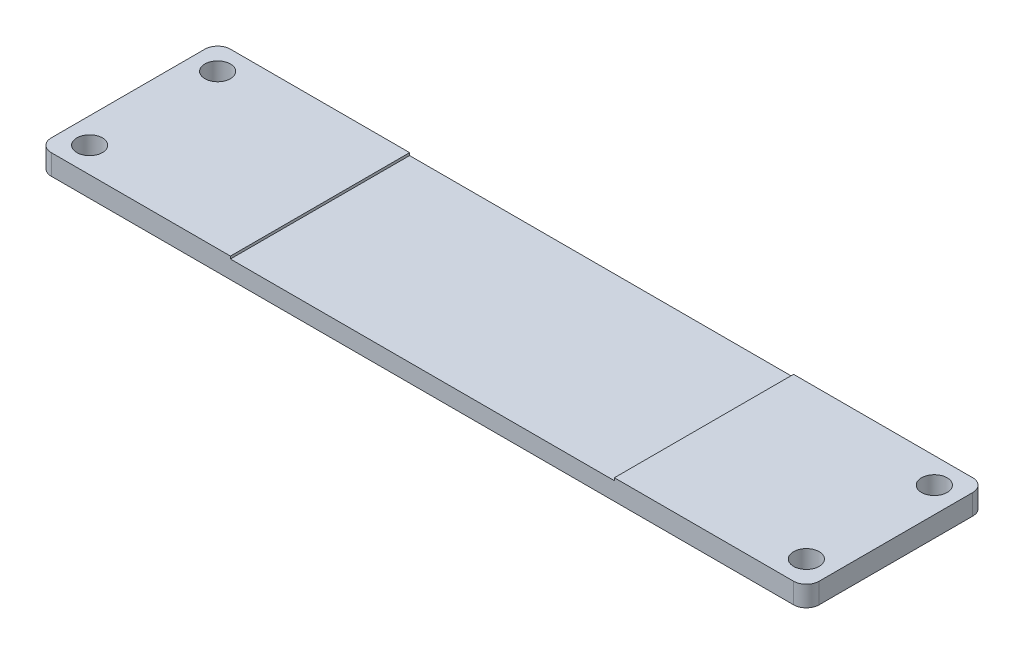
ISO-10303-21;
HEADER;
FILE_DESCRIPTION(('STEP AP214'),'2;1');
FILE_NAME('part.step','',(''),(''),'','','');
FILE_SCHEMA(('AUTOMOTIVE_DESIGN { 1 0 10303 214 1 1 1 1 }'));
ENDSEC;
DATA;
#1=APPLICATION_CONTEXT('core data for automotive mechanical design processes');
#2=APPLICATION_PROTOCOL_DEFINITION('international standard','automotive_design',2000,#1);
#3=PRODUCT_CONTEXT('',#1,'mechanical');
#4=PRODUCT('Part','Part','',(#3));
#5=PRODUCT_RELATED_PRODUCT_CATEGORY('part','',(#4));
#6=PRODUCT_DEFINITION_FORMATION('','',#4);
#7=PRODUCT_DEFINITION_CONTEXT('part definition',#1,'design');
#8=PRODUCT_DEFINITION('design','',#6,#7);
#9=PRODUCT_DEFINITION_SHAPE('','',#8);
#10=(LENGTH_UNIT() NAMED_UNIT(*) SI_UNIT(.MILLI.,.METRE.));
#11=(NAMED_UNIT(*) PLANE_ANGLE_UNIT() SI_UNIT($,.RADIAN.));
#12=(NAMED_UNIT(*) SI_UNIT($,.STERADIAN.) SOLID_ANGLE_UNIT());
#13=UNCERTAINTY_MEASURE_WITH_UNIT(LENGTH_MEASURE(1.E-05),#10,'distance_accuracy_value','');
#14=(GEOMETRIC_REPRESENTATION_CONTEXT(3) GLOBAL_UNCERTAINTY_ASSIGNED_CONTEXT((#13)) GLOBAL_UNIT_ASSIGNED_CONTEXT((#10,
#11,#12)) REPRESENTATION_CONTEXT('',''));
#15=CARTESIAN_POINT('',(0.,0.,0.));
#16=DIRECTION('',(0.,0.,1.));
#17=DIRECTION('',(1.,0.,0.));
#18=AXIS2_PLACEMENT_3D('',#15,#16,#17);
#19=CARTESIAN_POINT('',(0.,0.8,0.));
#20=DIRECTION('',(0.,1.,0.));
#21=DIRECTION('',(0.,0.,1.));
#22=AXIS2_PLACEMENT_3D('',#19,#20,#21);
#23=PLANE('',#22);
#24=DIRECTION('',(0.,0.,1.));
#25=VECTOR('',#24,1.);
#26=CARTESIAN_POINT('',(-7.5,0.8,3.5));
#27=LINE('',#26,#25);
#28=CARTESIAN_POINT('',(-7.5,0.8,-3.5));
#29=VERTEX_POINT('',#28);
#30=CARTESIAN_POINT('',(-7.5,0.8,3.5));
#31=VERTEX_POINT('',#30);
#32=EDGE_CURVE('E131',#29,#31,#27,.T.);
#33=ORIENTED_EDGE('',*,*,#32,.F.);
#34=DIRECTION('',(-1.,0.,0.));
#35=VECTOR('',#34,1.);
#36=CARTESIAN_POINT('',(15.,0.8,-3.5));
#37=LINE('',#36,#35);
#38=CARTESIAN_POINT('',(-14.5,0.8,-3.5));
#39=VERTEX_POINT('',#38);
#40=EDGE_CURVE('E60',#29,#39,#37,.T.);
#41=ORIENTED_EDGE('',*,*,#40,.T.);
#42=CARTESIAN_POINT('',(-14.5,0.8,-3.));
#43=DIRECTION('',(0.,1.,0.));
#44=DIRECTION('',(0.,0.,1.));
#45=AXIS2_PLACEMENT_3D('',#42,#43,#44);
#46=CIRCLE('',#45,0.5);
#47=CARTESIAN_POINT('',(-15.,0.8,-3.));
#48=VERTEX_POINT('',#47);
#49=EDGE_CURVE('E229',#39,#48,#46,.T.);
#50=ORIENTED_EDGE('',*,*,#49,.T.);
#51=DIRECTION('',(0.,0.,1.));
#52=VECTOR('',#51,1.);
#53=CARTESIAN_POINT('',(-15.,0.8,3.5));
#54=LINE('',#53,#52);
#55=CARTESIAN_POINT('',(-15.,0.8,3.));
#56=VERTEX_POINT('',#55);
#57=EDGE_CURVE('E187',#48,#56,#54,.T.);
#58=ORIENTED_EDGE('',*,*,#57,.T.);
#59=CARTESIAN_POINT('',(-14.5,0.8,3.));
#60=DIRECTION('',(0.,1.,0.));
#61=DIRECTION('',(0.,0.,1.));
#62=AXIS2_PLACEMENT_3D('',#59,#60,#61);
#63=CIRCLE('',#62,0.5);
#64=CARTESIAN_POINT('',(-14.5,0.8,3.5));
#65=VERTEX_POINT('',#64);
#66=EDGE_CURVE('E235',#56,#65,#63,.T.);
#67=ORIENTED_EDGE('',*,*,#66,.T.);
#68=DIRECTION('',(1.,0.,0.));
#69=VECTOR('',#68,1.);
#70=CARTESIAN_POINT('',(15.,0.8,3.5));
#71=LINE('',#70,#69);
#72=EDGE_CURVE('E192',#65,#31,#71,.T.);
#73=ORIENTED_EDGE('',*,*,#72,.T.);
#74=EDGE_LOOP('',(#33,#41,#50,#58,#67,#73));
#75=FACE_BOUND('',#74,.T.);
#76=CARTESIAN_POINT('',(-14.,0.8,-2.5));
#77=DIRECTION('',(0.,1.,0.));
#78=DIRECTION('',(0.,0.,1.));
#79=AXIS2_PLACEMENT_3D('',#76,#77,#78);
#80=CIRCLE('',#79,0.500000000000001);
#81=CARTESIAN_POINT('',(-14.,0.8,-2.));
#82=VERTEX_POINT('',#81);
#83=EDGE_CURVE('E166',#82,#82,#80,.T.);
#84=ORIENTED_EDGE('',*,*,#83,.F.);
#85=EDGE_LOOP('',(#84));
#86=FACE_BOUND('',#85,.T.);
#87=CARTESIAN_POINT('',(-14.,0.8,2.5));
#88=DIRECTION('',(0.,1.,0.));
#89=DIRECTION('',(0.,0.,-1.));
#90=AXIS2_PLACEMENT_3D('',#87,#88,#89);
#91=CIRCLE('',#90,0.500000000000001);
#92=CARTESIAN_POINT('',(-14.,0.8,2.));
#93=VERTEX_POINT('',#92);
#94=EDGE_CURVE('E158',#93,#93,#91,.T.);
#95=ORIENTED_EDGE('',*,*,#94,.F.);
#96=EDGE_LOOP('',(#95));
#97=FACE_BOUND('',#96,.T.);
#98=ADVANCED_FACE('F37',(#75,#86,#97),#23,.T.);
#99=CARTESIAN_POINT('',(-15.,0.8,3.5));
#100=DIRECTION('',(1.,0.,0.));
#101=DIRECTION('',(0.,0.,-1.));
#102=AXIS2_PLACEMENT_3D('',#99,#100,#101);
#103=PLANE('',#102);
#104=DIRECTION('',(0.,0.,1.));
#105=VECTOR('',#104,1.);
#106=CARTESIAN_POINT('',(-15.,0.,3.5));
#107=LINE('',#106,#105);
#108=CARTESIAN_POINT('',(-15.,0.,-3.));
#109=VERTEX_POINT('',#108);
#110=CARTESIAN_POINT('',(-15.,0.,3.));
#111=VERTEX_POINT('',#110);
#112=EDGE_CURVE('E184',#109,#111,#107,.T.);
#113=ORIENTED_EDGE('',*,*,#112,.T.);
#114=DIRECTION('',(0.,-1.,0.));
#115=VECTOR('',#114,1.);
#116=CARTESIAN_POINT('',(-15.,0.8,3.));
#117=LINE('',#116,#115);
#118=EDGE_CURVE('E227',#111,#56,#117,.F.);
#119=ORIENTED_EDGE('',*,*,#118,.T.);
#120=ORIENTED_EDGE('',*,*,#57,.F.);
#121=DIRECTION('',(0.,-1.,0.));
#122=VECTOR('',#121,1.);
#123=CARTESIAN_POINT('',(-15.,0.8,-3.));
#124=LINE('',#123,#122);
#125=EDGE_CURVE('E224',#48,#109,#124,.T.);
#126=ORIENTED_EDGE('',*,*,#125,.T.);
#127=EDGE_LOOP('',(#113,#119,#120,#126));
#128=FACE_BOUND('',#127,.T.);
#129=ADVANCED_FACE('F252',(#128),#103,.F.);
#130=CARTESIAN_POINT('',(15.,0.8,3.5));
#131=DIRECTION('',(0.,0.,-1.));
#132=DIRECTION('',(-1.,0.,0.));
#133=AXIS2_PLACEMENT_3D('',#130,#131,#132);
#134=PLANE('',#133);
#135=DIRECTION('',(1.,0.,0.));
#136=VECTOR('',#135,1.);
#137=CARTESIAN_POINT('',(7.5,0.7,3.5));
#138=LINE('',#137,#136);
#139=CARTESIAN_POINT('',(-7.5,0.7,3.5));
#140=VERTEX_POINT('',#139);
#141=CARTESIAN_POINT('',(7.5,0.7,3.5));
#142=VERTEX_POINT('',#141);
#143=EDGE_CURVE('E142',#140,#142,#138,.T.);
#144=ORIENTED_EDGE('',*,*,#143,.F.);
#145=DIRECTION('',(0.,1.,0.));
#146=VECTOR('',#145,1.);
#147=CARTESIAN_POINT('',(-7.5,0.7,3.5));
#148=LINE('',#147,#146);
#149=EDGE_CURVE('E126',#140,#31,#148,.T.);
#150=ORIENTED_EDGE('',*,*,#149,.T.);
#151=ORIENTED_EDGE('',*,*,#72,.F.);
#152=DIRECTION('',(0.,-1.,0.));
#153=VECTOR('',#152,1.);
#154=CARTESIAN_POINT('',(-14.5,0.8,3.5));
#155=LINE('',#154,#153);
#156=CARTESIAN_POINT('',(-14.5,0.,3.5));
#157=VERTEX_POINT('',#156);
#158=EDGE_CURVE('E213',#65,#157,#155,.T.);
#159=ORIENTED_EDGE('',*,*,#158,.T.);
#160=DIRECTION('',(1.,0.,0.));
#161=VECTOR('',#160,1.);
#162=CARTESIAN_POINT('',(15.,0.,3.5));
#163=LINE('',#162,#161);
#164=CARTESIAN_POINT('',(14.5,0.,3.5));
#165=VERTEX_POINT('',#164);
#166=EDGE_CURVE('E203',#157,#165,#163,.T.);
#167=ORIENTED_EDGE('',*,*,#166,.T.);
#168=DIRECTION('',(0.,-1.,0.));
#169=VECTOR('',#168,1.);
#170=CARTESIAN_POINT('',(14.5,0.8,3.5));
#171=LINE('',#170,#169);
#172=CARTESIAN_POINT('',(14.5,0.8,3.5));
#173=VERTEX_POINT('',#172);
#174=EDGE_CURVE('E200',#165,#173,#171,.F.);
#175=ORIENTED_EDGE('',*,*,#174,.T.);
#176=CARTESIAN_POINT('',(7.5,0.8,3.5));
#177=VERTEX_POINT('',#176);
#178=EDGE_CURVE('E190',#177,#173,#71,.T.);
#179=ORIENTED_EDGE('',*,*,#178,.F.);
#180=DIRECTION('',(0.,1.,0.));
#181=VECTOR('',#180,1.);
#182=CARTESIAN_POINT('',(7.5,0.7,3.5));
#183=LINE('',#182,#181);
#184=EDGE_CURVE('E52',#142,#177,#183,.T.);
#185=ORIENTED_EDGE('',*,*,#184,.F.);
#186=EDGE_LOOP('',(#144,#150,#151,#159,#167,#175,#179,#185));
#187=FACE_BOUND('',#186,.T.);
#188=ADVANCED_FACE('F147',(#187),#134,.F.);
#189=CARTESIAN_POINT('',(15.,0.8,3.5));
#190=DIRECTION('',(-1.,0.,0.));
#191=DIRECTION('',(0.,0.,1.));
#192=AXIS2_PLACEMENT_3D('',#189,#190,#191);
#193=PLANE('',#192);
#194=DIRECTION('',(0.,0.,-1.));
#195=VECTOR('',#194,1.);
#196=CARTESIAN_POINT('',(15.,0.8,3.5));
#197=LINE('',#196,#195);
#198=CARTESIAN_POINT('',(15.,0.8,3.));
#199=VERTEX_POINT('',#198);
#200=CARTESIAN_POINT('',(15.,0.8,-3.));
#201=VERTEX_POINT('',#200);
#202=EDGE_CURVE('E194',#199,#201,#197,.T.);
#203=ORIENTED_EDGE('',*,*,#202,.F.);
#204=DIRECTION('',(0.,-1.,0.));
#205=VECTOR('',#204,1.);
#206=CARTESIAN_POINT('',(15.,0.8,3.));
#207=LINE('',#206,#205);
#208=CARTESIAN_POINT('',(15.,0.,3.));
#209=VERTEX_POINT('',#208);
#210=EDGE_CURVE('E239',#199,#209,#207,.T.);
#211=ORIENTED_EDGE('',*,*,#210,.T.);
#212=DIRECTION('',(0.,0.,-1.));
#213=VECTOR('',#212,1.);
#214=CARTESIAN_POINT('',(15.,0.,3.5));
#215=LINE('',#214,#213);
#216=CARTESIAN_POINT('',(15.,0.,-3.));
#217=VERTEX_POINT('',#216);
#218=EDGE_CURVE('E206',#209,#217,#215,.T.);
#219=ORIENTED_EDGE('',*,*,#218,.T.);
#220=DIRECTION('',(0.,-1.,0.));
#221=VECTOR('',#220,1.);
#222=CARTESIAN_POINT('',(15.,0.8,-3.));
#223=LINE('',#222,#221);
#224=EDGE_CURVE('E237',#217,#201,#223,.F.);
#225=ORIENTED_EDGE('',*,*,#224,.T.);
#226=EDGE_LOOP('',(#203,#211,#219,#225));
#227=FACE_BOUND('',#226,.T.);
#228=ADVANCED_FACE('F269',(#227),#193,.F.);
#229=CARTESIAN_POINT('',(15.,0.8,-3.5));
#230=DIRECTION('',(0.,0.,1.));
#231=DIRECTION('',(1.,0.,0.));
#232=AXIS2_PLACEMENT_3D('',#229,#230,#231);
#233=PLANE('',#232);
#234=ORIENTED_EDGE('',*,*,#40,.F.);
#235=DIRECTION('',(0.,1.,0.));
#236=VECTOR('',#235,1.);
#237=CARTESIAN_POINT('',(-7.5,0.7,-3.5));
#238=LINE('',#237,#236);
#239=CARTESIAN_POINT('',(-7.5,0.7,-3.5));
#240=VERTEX_POINT('',#239);
#241=EDGE_CURVE('E156',#240,#29,#238,.T.);
#242=ORIENTED_EDGE('',*,*,#241,.F.);
#243=DIRECTION('',(-1.,0.,0.));
#244=VECTOR('',#243,1.);
#245=CARTESIAN_POINT('',(7.5,0.7,-3.5));
#246=LINE('',#245,#244);
#247=CARTESIAN_POINT('',(7.5,0.7,-3.5));
#248=VERTEX_POINT('',#247);
#249=EDGE_CURVE('E136',#248,#240,#246,.T.);
#250=ORIENTED_EDGE('',*,*,#249,.F.);
#251=DIRECTION('',(0.,1.,0.));
#252=VECTOR('',#251,1.);
#253=CARTESIAN_POINT('',(7.5,0.7,-3.5));
#254=LINE('',#253,#252);
#255=CARTESIAN_POINT('',(7.5,0.8,-3.5));
#256=VERTEX_POINT('',#255);
#257=EDGE_CURVE('E159',#248,#256,#254,.T.);
#258=ORIENTED_EDGE('',*,*,#257,.T.);
#259=CARTESIAN_POINT('',(14.5,0.8,-3.5));
#260=VERTEX_POINT('',#259);
#261=EDGE_CURVE('E197',#260,#256,#37,.T.);
#262=ORIENTED_EDGE('',*,*,#261,.F.);
#263=DIRECTION('',(0.,-1.,0.));
#264=VECTOR('',#263,1.);
#265=CARTESIAN_POINT('',(14.5,0.8,-3.5));
#266=LINE('',#265,#264);
#267=CARTESIAN_POINT('',(14.5,0.,-3.5));
#268=VERTEX_POINT('',#267);
#269=EDGE_CURVE('E11',#260,#268,#266,.T.);
#270=ORIENTED_EDGE('',*,*,#269,.T.);
#271=DIRECTION('',(-1.,0.,0.));
#272=VECTOR('',#271,1.);
#273=CARTESIAN_POINT('',(15.,0.,-3.5));
#274=LINE('',#273,#272);
#275=CARTESIAN_POINT('',(-14.5,0.,-3.5));
#276=VERTEX_POINT('',#275);
#277=EDGE_CURVE('E191',#268,#276,#274,.T.);
#278=ORIENTED_EDGE('',*,*,#277,.T.);
#279=DIRECTION('',(0.,-1.,0.));
#280=VECTOR('',#279,1.);
#281=CARTESIAN_POINT('',(-14.5,0.8,-3.5));
#282=LINE('',#281,#280);
#283=EDGE_CURVE('E45',#276,#39,#282,.F.);
#284=ORIENTED_EDGE('',*,*,#283,.T.);
#285=EDGE_LOOP('',(#234,#242,#250,#258,#262,#270,#278,#284));
#286=FACE_BOUND('',#285,.T.);
#287=ADVANCED_FACE('F244',(#286),#233,.F.);
#288=DIRECTION('',(0.,0.,-1.));
#289=VECTOR('',#288,1.);
#290=CARTESIAN_POINT('',(7.5,0.8,3.5));
#291=LINE('',#290,#289);
#292=EDGE_CURVE('E145',#177,#256,#291,.T.);
#293=ORIENTED_EDGE('',*,*,#292,.F.);
#294=ORIENTED_EDGE('',*,*,#178,.T.);
#295=CARTESIAN_POINT('',(14.5,0.8,3.));
#296=DIRECTION('',(0.,1.,0.));
#297=DIRECTION('',(0.,0.,1.));
#298=AXIS2_PLACEMENT_3D('',#295,#296,#297);
#299=CIRCLE('',#298,0.5);
#300=EDGE_CURVE('E233',#173,#199,#299,.T.);
#301=ORIENTED_EDGE('',*,*,#300,.T.);
#302=ORIENTED_EDGE('',*,*,#202,.T.);
#303=CARTESIAN_POINT('',(14.5,0.8,-3.));
#304=DIRECTION('',(0.,1.,0.));
#305=DIRECTION('',(0.,0.,1.));
#306=AXIS2_PLACEMENT_3D('',#303,#304,#305);
#307=CIRCLE('',#306,0.5);
#308=EDGE_CURVE('E231',#201,#260,#307,.T.);
#309=ORIENTED_EDGE('',*,*,#308,.T.);
#310=ORIENTED_EDGE('',*,*,#261,.T.);
#311=EDGE_LOOP('',(#293,#294,#301,#302,#309,#310));
#312=FACE_BOUND('',#311,.T.);
#313=CARTESIAN_POINT('',(14.,0.8,2.50000000000001));
#314=DIRECTION('',(0.,1.,0.));
#315=DIRECTION('',(0.,0.,1.));
#316=AXIS2_PLACEMENT_3D('',#313,#314,#315);
#317=CIRCLE('',#316,0.500000000000001);
#318=CARTESIAN_POINT('',(14.,0.8,3.00000000000001));
#319=VERTEX_POINT('',#318);
#320=EDGE_CURVE('E173',#319,#319,#317,.T.);
#321=ORIENTED_EDGE('',*,*,#320,.F.);
#322=EDGE_LOOP('',(#321));
#323=FACE_BOUND('',#322,.T.);
#324=CARTESIAN_POINT('',(14.,0.8,-2.50000000000001));
#325=DIRECTION('',(0.,1.,0.));
#326=DIRECTION('',(0.,0.,-1.));
#327=AXIS2_PLACEMENT_3D('',#324,#325,#326);
#328=CIRCLE('',#327,0.500000000000001);
#329=CARTESIAN_POINT('',(14.,0.8,-3.00000000000001));
#330=VERTEX_POINT('',#329);
#331=EDGE_CURVE('E167',#330,#330,#328,.T.);
#332=ORIENTED_EDGE('',*,*,#331,.F.);
#333=EDGE_LOOP('',(#332));
#334=FACE_BOUND('',#333,.T.);
#335=ADVANCED_FACE('F273',(#312,#323,#334),#23,.T.);
#336=CARTESIAN_POINT('',(0.,0.,0.));
#337=DIRECTION('',(0.,1.,0.));
#338=DIRECTION('',(0.,0.,1.));
#339=AXIS2_PLACEMENT_3D('',#336,#337,#338);
#340=PLANE('',#339);
#341=CARTESIAN_POINT('',(-14.,0.,2.5));
#342=DIRECTION('',(0.,1.,0.));
#343=DIRECTION('',(0.,0.,-1.));
#344=AXIS2_PLACEMENT_3D('',#341,#342,#343);
#345=CIRCLE('',#344,0.500000000000001);
#346=CARTESIAN_POINT('',(-14.,0.,2.));
#347=VERTEX_POINT('',#346);
#348=EDGE_CURVE('E176',#347,#347,#345,.T.);
#349=ORIENTED_EDGE('',*,*,#348,.T.);
#350=EDGE_LOOP('',(#349));
#351=FACE_BOUND('',#350,.T.);
#352=CARTESIAN_POINT('',(14.,0.,2.50000000000001));
#353=DIRECTION('',(0.,1.,0.));
#354=DIRECTION('',(0.,0.,1.));
#355=AXIS2_PLACEMENT_3D('',#352,#353,#354);
#356=CIRCLE('',#355,0.500000000000001);
#357=CARTESIAN_POINT('',(14.,0.,3.00000000000001));
#358=VERTEX_POINT('',#357);
#359=EDGE_CURVE('E170',#358,#358,#356,.T.);
#360=ORIENTED_EDGE('',*,*,#359,.T.);
#361=EDGE_LOOP('',(#360));
#362=FACE_BOUND('',#361,.T.);
#363=CARTESIAN_POINT('',(14.,0.,-2.50000000000001));
#364=DIRECTION('',(0.,1.,0.));
#365=DIRECTION('',(0.,0.,-1.));
#366=AXIS2_PLACEMENT_3D('',#363,#364,#365);
#367=CIRCLE('',#366,0.500000000000001);
#368=CARTESIAN_POINT('',(14.,0.,-3.00000000000001));
#369=VERTEX_POINT('',#368);
#370=EDGE_CURVE('E163',#369,#369,#367,.T.);
#371=ORIENTED_EDGE('',*,*,#370,.T.);
#372=EDGE_LOOP('',(#371));
#373=FACE_BOUND('',#372,.T.);
#374=CARTESIAN_POINT('',(-14.,0.,-2.5));
#375=DIRECTION('',(0.,1.,0.));
#376=DIRECTION('',(0.,0.,1.));
#377=AXIS2_PLACEMENT_3D('',#374,#375,#376);
#378=CIRCLE('',#377,0.500000000000001);
#379=CARTESIAN_POINT('',(-14.,0.,-2.));
#380=VERTEX_POINT('',#379);
#381=EDGE_CURVE('E181',#380,#380,#378,.T.);
#382=ORIENTED_EDGE('',*,*,#381,.T.);
#383=EDGE_LOOP('',(#382));
#384=FACE_BOUND('',#383,.T.);
#385=ORIENTED_EDGE('',*,*,#166,.F.);
#386=CARTESIAN_POINT('',(-14.5,0.,3.));
#387=DIRECTION('',(0.,1.,0.));
#388=DIRECTION('',(0.,0.,1.));
#389=AXIS2_PLACEMENT_3D('',#386,#387,#388);
#390=CIRCLE('',#389,0.5);
#391=EDGE_CURVE('E222',#157,#111,#390,.F.);
#392=ORIENTED_EDGE('',*,*,#391,.T.);
#393=ORIENTED_EDGE('',*,*,#112,.F.);
#394=CARTESIAN_POINT('',(-14.5,0.,-3.));
#395=DIRECTION('',(0.,1.,0.));
#396=DIRECTION('',(0.,0.,1.));
#397=AXIS2_PLACEMENT_3D('',#394,#395,#396);
#398=CIRCLE('',#397,0.5);
#399=EDGE_CURVE('E216',#109,#276,#398,.F.);
#400=ORIENTED_EDGE('',*,*,#399,.T.);
#401=ORIENTED_EDGE('',*,*,#277,.F.);
#402=CARTESIAN_POINT('',(14.5,0.,-3.));
#403=DIRECTION('',(0.,1.,0.));
#404=DIRECTION('',(0.,0.,1.));
#405=AXIS2_PLACEMENT_3D('',#402,#403,#404);
#406=CIRCLE('',#405,0.5);
#407=EDGE_CURVE('E218',#268,#217,#406,.F.);
#408=ORIENTED_EDGE('',*,*,#407,.T.);
#409=ORIENTED_EDGE('',*,*,#218,.F.);
#410=CARTESIAN_POINT('',(14.5,0.,3.));
#411=DIRECTION('',(0.,1.,0.));
#412=DIRECTION('',(0.,0.,1.));
#413=AXIS2_PLACEMENT_3D('',#410,#411,#412);
#414=CIRCLE('',#413,0.5);
#415=EDGE_CURVE('E220',#209,#165,#414,.F.);
#416=ORIENTED_EDGE('',*,*,#415,.T.);
#417=EDGE_LOOP('',(#385,#392,#393,#400,#401,#408,#409,#416));
#418=FACE_BOUND('',#417,.T.);
#419=ADVANCED_FACE('F261',(#351,#362,#373,#384,#418),#340,.F.);
#420=CARTESIAN_POINT('',(-14.,0.,-2.5));
#421=DIRECTION('',(0.,1.,0.));
#422=DIRECTION('',(0.,0.,1.));
#423=AXIS2_PLACEMENT_3D('',#420,#421,#422);
#424=CYLINDRICAL_SURFACE('',#423,0.500000000000001);
#425=ORIENTED_EDGE('',*,*,#381,.F.);
#426=EDGE_LOOP('',(#425));
#427=FACE_BOUND('',#426,.T.);
#428=ORIENTED_EDGE('',*,*,#83,.T.);
#429=EDGE_LOOP('',(#428));
#430=FACE_BOUND('',#429,.T.);
#431=ADVANCED_FACE('F301',(#427,#430),#424,.F.);
#432=CARTESIAN_POINT('',(14.,0.,-2.50000000000001));
#433=DIRECTION('',(0.,1.,0.));
#434=DIRECTION('',(0.,0.,1.));
#435=AXIS2_PLACEMENT_3D('',#432,#433,#434);
#436=CYLINDRICAL_SURFACE('',#435,0.500000000000001);
#437=ORIENTED_EDGE('',*,*,#370,.F.);
#438=EDGE_LOOP('',(#437));
#439=FACE_BOUND('',#438,.T.);
#440=ORIENTED_EDGE('',*,*,#331,.T.);
#441=EDGE_LOOP('',(#440));
#442=FACE_BOUND('',#441,.T.);
#443=ADVANCED_FACE('F393',(#439,#442),#436,.F.);
#444=CARTESIAN_POINT('',(14.,0.,2.50000000000001));
#445=DIRECTION('',(0.,1.,0.));
#446=DIRECTION('',(0.,0.,1.));
#447=AXIS2_PLACEMENT_3D('',#444,#445,#446);
#448=CYLINDRICAL_SURFACE('',#447,0.500000000000001);
#449=ORIENTED_EDGE('',*,*,#359,.F.);
#450=EDGE_LOOP('',(#449));
#451=FACE_BOUND('',#450,.T.);
#452=ORIENTED_EDGE('',*,*,#320,.T.);
#453=EDGE_LOOP('',(#452));
#454=FACE_BOUND('',#453,.T.);
#455=ADVANCED_FACE('F383',(#451,#454),#448,.F.);
#456=CARTESIAN_POINT('',(-14.,0.,2.5));
#457=DIRECTION('',(0.,1.,0.));
#458=DIRECTION('',(0.,0.,1.));
#459=AXIS2_PLACEMENT_3D('',#456,#457,#458);
#460=CYLINDRICAL_SURFACE('',#459,0.500000000000001);
#461=ORIENTED_EDGE('',*,*,#348,.F.);
#462=EDGE_LOOP('',(#461));
#463=FACE_BOUND('',#462,.T.);
#464=ORIENTED_EDGE('',*,*,#94,.T.);
#465=EDGE_LOOP('',(#464));
#466=FACE_BOUND('',#465,.T.);
#467=ADVANCED_FACE('F313',(#463,#466),#460,.F.);
#468=CARTESIAN_POINT('',(-14.5,0.8,3.));
#469=DIRECTION('',(0.,-1.,0.));
#470=DIRECTION('',(0.,0.,-1.));
#471=AXIS2_PLACEMENT_3D('',#468,#469,#470);
#472=CYLINDRICAL_SURFACE('',#471,0.5);
#473=ORIENTED_EDGE('',*,*,#66,.F.);
#474=ORIENTED_EDGE('',*,*,#118,.F.);
#475=ORIENTED_EDGE('',*,*,#391,.F.);
#476=ORIENTED_EDGE('',*,*,#158,.F.);
#477=EDGE_LOOP('',(#473,#474,#475,#476));
#478=FACE_BOUND('',#477,.T.);
#479=ADVANCED_FACE('F256',(#478),#472,.T.);
#480=CARTESIAN_POINT('',(14.5,0.8,3.));
#481=DIRECTION('',(0.,-1.,0.));
#482=DIRECTION('',(0.,0.,-1.));
#483=AXIS2_PLACEMENT_3D('',#480,#481,#482);
#484=CYLINDRICAL_SURFACE('',#483,0.5);
#485=ORIENTED_EDGE('',*,*,#300,.F.);
#486=ORIENTED_EDGE('',*,*,#174,.F.);
#487=ORIENTED_EDGE('',*,*,#415,.F.);
#488=ORIENTED_EDGE('',*,*,#210,.F.);
#489=EDGE_LOOP('',(#485,#486,#487,#488));
#490=FACE_BOUND('',#489,.T.);
#491=ADVANCED_FACE('F266',(#490),#484,.T.);
#492=CARTESIAN_POINT('',(14.5,0.8,-3.));
#493=DIRECTION('',(0.,-1.,0.));
#494=DIRECTION('',(0.,0.,-1.));
#495=AXIS2_PLACEMENT_3D('',#492,#493,#494);
#496=CYLINDRICAL_SURFACE('',#495,0.5);
#497=ORIENTED_EDGE('',*,*,#308,.F.);
#498=ORIENTED_EDGE('',*,*,#224,.F.);
#499=ORIENTED_EDGE('',*,*,#407,.F.);
#500=ORIENTED_EDGE('',*,*,#269,.F.);
#501=EDGE_LOOP('',(#497,#498,#499,#500));
#502=FACE_BOUND('',#501,.T.);
#503=ADVANCED_FACE('F278',(#502),#496,.T.);
#504=CARTESIAN_POINT('',(-14.5,0.8,-3.));
#505=DIRECTION('',(0.,-1.,0.));
#506=DIRECTION('',(0.,0.,-1.));
#507=AXIS2_PLACEMENT_3D('',#504,#505,#506);
#508=CYLINDRICAL_SURFACE('',#507,0.5);
#509=ORIENTED_EDGE('',*,*,#49,.F.);
#510=ORIENTED_EDGE('',*,*,#283,.F.);
#511=ORIENTED_EDGE('',*,*,#399,.F.);
#512=ORIENTED_EDGE('',*,*,#125,.F.);
#513=EDGE_LOOP('',(#509,#510,#511,#512));
#514=FACE_BOUND('',#513,.T.);
#515=ADVANCED_FACE('F39',(#514),#508,.T.);
#516=CARTESIAN_POINT('',(-7.5,0.7,3.5));
#517=DIRECTION('',(-1.,0.,0.));
#518=DIRECTION('',(0.,0.,1.));
#519=AXIS2_PLACEMENT_3D('',#516,#517,#518);
#520=PLANE('',#519);
#521=ORIENTED_EDGE('',*,*,#32,.T.);
#522=ORIENTED_EDGE('',*,*,#149,.F.);
#523=DIRECTION('',(0.,0.,1.));
#524=VECTOR('',#523,1.);
#525=CARTESIAN_POINT('',(-7.5,0.7,3.5));
#526=LINE('',#525,#524);
#527=EDGE_CURVE('E129',#240,#140,#526,.T.);
#528=ORIENTED_EDGE('',*,*,#527,.F.);
#529=ORIENTED_EDGE('',*,*,#241,.T.);
#530=EDGE_LOOP('',(#521,#522,#528,#529));
#531=FACE_BOUND('',#530,.T.);
#532=ADVANCED_FACE('F128',(#531),#520,.F.);
#533=CARTESIAN_POINT('',(7.5,0.7,3.5));
#534=DIRECTION('',(1.,0.,0.));
#535=DIRECTION('',(0.,0.,-1.));
#536=AXIS2_PLACEMENT_3D('',#533,#534,#535);
#537=PLANE('',#536);
#538=ORIENTED_EDGE('',*,*,#292,.T.);
#539=ORIENTED_EDGE('',*,*,#257,.F.);
#540=DIRECTION('',(0.,0.,-1.));
#541=VECTOR('',#540,1.);
#542=CARTESIAN_POINT('',(7.5,0.7,3.5));
#543=LINE('',#542,#541);
#544=EDGE_CURVE('E149',#142,#248,#543,.T.);
#545=ORIENTED_EDGE('',*,*,#544,.F.);
#546=ORIENTED_EDGE('',*,*,#184,.T.);
#547=EDGE_LOOP('',(#538,#539,#545,#546));
#548=FACE_BOUND('',#547,.T.);
#549=ADVANCED_FACE('F279',(#548),#537,.F.);
#550=CARTESIAN_POINT('',(0.,0.7,0.));
#551=DIRECTION('',(0.,1.,0.));
#552=DIRECTION('',(0.,0.,1.));
#553=AXIS2_PLACEMENT_3D('',#550,#551,#552);
#554=PLANE('',#553);
#555=ORIENTED_EDGE('',*,*,#527,.T.);
#556=ORIENTED_EDGE('',*,*,#143,.T.);
#557=ORIENTED_EDGE('',*,*,#544,.T.);
#558=ORIENTED_EDGE('',*,*,#249,.T.);
#559=EDGE_LOOP('',(#555,#556,#557,#558));
#560=FACE_BOUND('',#559,.T.);
#561=ADVANCED_FACE('F140',(#560),#554,.T.);
#562=CLOSED_SHELL('',(#98,#129,#188,#228,#287,#335,#419,#431,#443,#455,#467,#479,#491,#503,#515,
#532,#549,#561));
#563=MANIFOLD_SOLID_BREP('B2',#562);
#564=ADVANCED_BREP_SHAPE_REPRESENTATION('',(#18,#563),#14);
#565=SHAPE_DEFINITION_REPRESENTATION(#9,#564);
ENDSEC;
END-ISO-10303-21;
